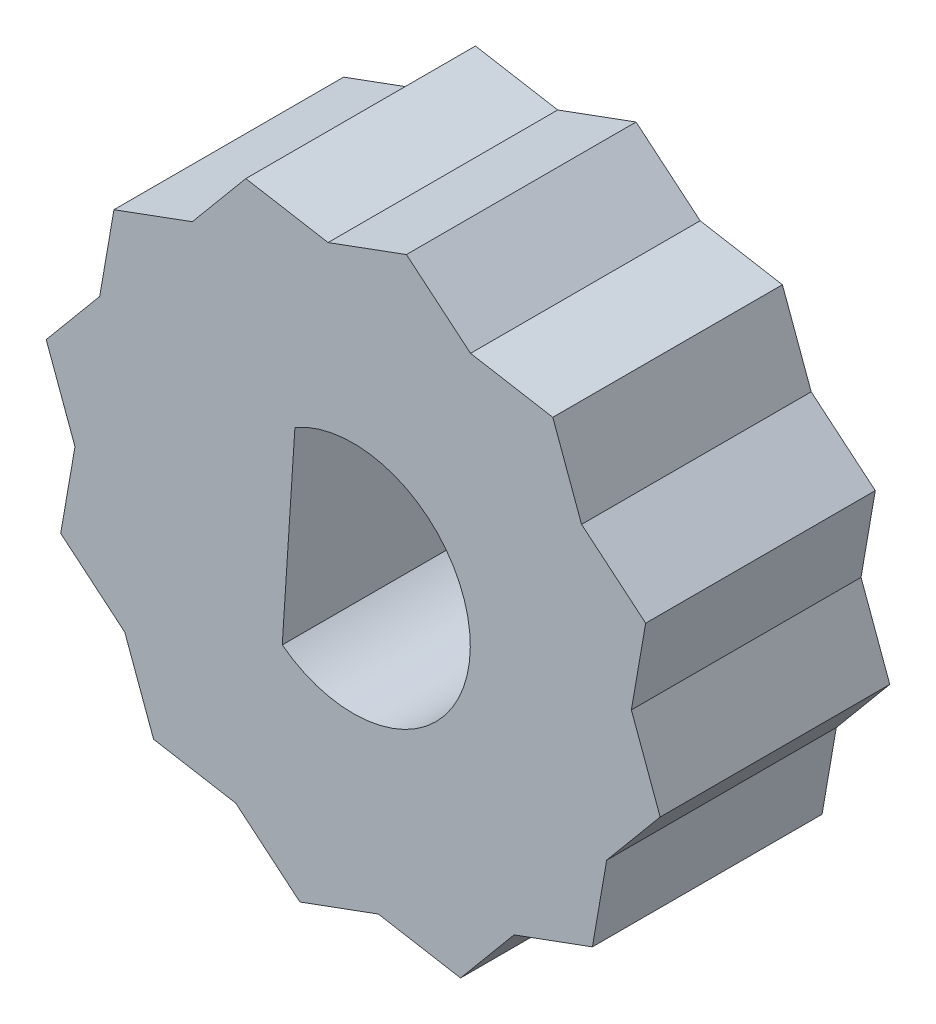
ISO-10303-21;
HEADER;
FILE_DESCRIPTION(('STEP AP214'),'2;1');
FILE_NAME('part.step','',(''),(''),'','','');
FILE_SCHEMA(('AUTOMOTIVE_DESIGN { 1 0 10303 214 1 1 1 1 }'));
ENDSEC;
DATA;
#1=APPLICATION_CONTEXT('core data for automotive mechanical design processes');
#2=APPLICATION_PROTOCOL_DEFINITION('international standard','automotive_design',2000,#1);
#3=PRODUCT_CONTEXT('',#1,'mechanical');
#4=PRODUCT('Part','Part','',(#3));
#5=PRODUCT_RELATED_PRODUCT_CATEGORY('part','',(#4));
#6=PRODUCT_DEFINITION_FORMATION('','',#4);
#7=PRODUCT_DEFINITION_CONTEXT('part definition',#1,'design');
#8=PRODUCT_DEFINITION('design','',#6,#7);
#9=PRODUCT_DEFINITION_SHAPE('','',#8);
#10=(LENGTH_UNIT() NAMED_UNIT(*) SI_UNIT(.MILLI.,.METRE.));
#11=(NAMED_UNIT(*) PLANE_ANGLE_UNIT() SI_UNIT($,.RADIAN.));
#12=(NAMED_UNIT(*) SI_UNIT($,.STERADIAN.) SOLID_ANGLE_UNIT());
#13=UNCERTAINTY_MEASURE_WITH_UNIT(LENGTH_MEASURE(1.E-05),#10,'distance_accuracy_value','');
#14=(GEOMETRIC_REPRESENTATION_CONTEXT(3) GLOBAL_UNCERTAINTY_ASSIGNED_CONTEXT((#13)) GLOBAL_UNIT_ASSIGNED_CONTEXT((#10,
#11,#12)) REPRESENTATION_CONTEXT('',''));
#15=CARTESIAN_POINT('',(0.,0.,0.));
#16=DIRECTION('',(0.,0.,1.));
#17=DIRECTION('',(1.,0.,0.));
#18=AXIS2_PLACEMENT_3D('',#15,#16,#17);
#19=CARTESIAN_POINT('',(0.,0.,10.));
#20=DIRECTION('',(0.,0.,-1.));
#21=DIRECTION('',(-1.,0.,0.));
#22=AXIS2_PLACEMENT_3D('',#19,#20,#21);
#23=CYLINDRICAL_SURFACE('',#22,5.1);
#24=CARTESIAN_POINT('',(0.,0.,0.));
#25=DIRECTION('',(0.,0.,1.));
#26=DIRECTION('',(1.,0.,0.));
#27=AXIS2_PLACEMENT_3D('',#24,#25,#26);
#28=CIRCLE('',#27,5.1);
#29=CARTESIAN_POINT('',(-3.08920951020173,-4.057928609781,0.));
#30=VERTEX_POINT('',#29);
#31=CARTESIAN_POINT('',(-2.53714814178046,4.4241246938417,0.));
#32=VERTEX_POINT('',#31);
#33=EDGE_CURVE('E243',#30,#32,#28,.T.);
#34=ORIENTED_EDGE('',*,*,#33,.F.);
#35=DIRECTION('',(0.,0.,-1.));
#36=VECTOR('',#35,1.);
#37=CARTESIAN_POINT('',(-3.08920951020173,-4.057928609781,10.));
#38=LINE('',#37,#36);
#39=CARTESIAN_POINT('',(-3.08920951020173,-4.057928609781,10.));
#40=VERTEX_POINT('',#39);
#41=EDGE_CURVE('E11',#40,#30,#38,.T.);
#42=ORIENTED_EDGE('',*,*,#41,.F.);
#43=CARTESIAN_POINT('',(0.,0.,10.));
#44=DIRECTION('',(0.,0.,1.));
#45=DIRECTION('',(1.,0.,0.));
#46=AXIS2_PLACEMENT_3D('',#43,#44,#45);
#47=CIRCLE('',#46,5.1);
#48=CARTESIAN_POINT('',(-2.53714814178046,4.4241246938417,10.));
#49=VERTEX_POINT('',#48);
#50=EDGE_CURVE('E227',#40,#49,#47,.T.);
#51=ORIENTED_EDGE('',*,*,#50,.T.);
#52=DIRECTION('',(0.,0.,-1.));
#53=VECTOR('',#52,1.);
#54=CARTESIAN_POINT('',(-2.53714814178046,4.4241246938417,10.));
#55=LINE('',#54,#53);
#56=EDGE_CURVE('E45',#49,#32,#55,.T.);
#57=ORIENTED_EDGE('',*,*,#56,.T.);
#58=EDGE_LOOP('',(#34,#42,#51,#57));
#59=FACE_BOUND('',#58,.T.);
#60=ADVANCED_FACE('F35',(#59),#23,.F.);
#61=CARTESIAN_POINT('',(-4.04929492394042,11.0302180676064,10.));
#62=DIRECTION('',(0.344620844590674,-0.938741963200544,0.));
#63=DIRECTION('',(0.938741963200544,0.344620844590674,0.));
#64=AXIS2_PLACEMENT_3D('',#61,#62,#63);
#65=PLANE('',#64);
#66=DIRECTION('',(-0.938741963200544,-0.344620844590674,0.));
#67=VECTOR('',#66,1.);
#68=CARTESIAN_POINT('',(-4.04929492394042,11.0302180676064,0.));
#69=LINE('',#68,#67);
#70=CARTESIAN_POINT('',(-7.00483294749473,9.94521276282111,0.));
#71=VERTEX_POINT('',#70);
#72=CARTESIAN_POINT('',(-10.4175942944932,8.69235655324121,0.));
#73=VERTEX_POINT('',#72);
#74=EDGE_CURVE('E288',#71,#73,#69,.T.);
#75=ORIENTED_EDGE('',*,*,#74,.T.);
#76=DIRECTION('',(0.,0.,-1.));
#77=VECTOR('',#76,1.);
#78=CARTESIAN_POINT('',(-10.4175942944932,8.69235655324121,10.));
#79=LINE('',#78,#77);
#80=CARTESIAN_POINT('',(-10.4175942944932,8.69235655324121,10.));
#81=VERTEX_POINT('',#80);
#82=EDGE_CURVE('E39',#81,#73,#79,.T.);
#83=ORIENTED_EDGE('',*,*,#82,.F.);
#84=DIRECTION('',(-0.938741963200544,-0.344620844590674,0.));
#85=VECTOR('',#84,1.);
#86=CARTESIAN_POINT('',(-4.04929492394042,11.0302180676064,10.));
#87=LINE('',#86,#85);
#88=CARTESIAN_POINT('',(-7.00483294749473,9.94521276282111,10.));
#89=VERTEX_POINT('',#88);
#90=EDGE_CURVE('E220',#89,#81,#87,.T.);
#91=ORIENTED_EDGE('',*,*,#90,.F.);
#92=DIRECTION('',(0.,0.,-1.));
#93=VECTOR('',#92,1.);
#94=CARTESIAN_POINT('',(-7.00483294749473,9.94521276282111,10.));
#95=LINE('',#94,#93);
#96=EDGE_CURVE('E230',#89,#71,#95,.T.);
#97=ORIENTED_EDGE('',*,*,#96,.T.);
#98=EDGE_LOOP('',(#75,#83,#91,#97));
#99=FACE_BOUND('',#98,.T.);
#100=ADVANCED_FACE('F37',(#99),#65,.F.);
#101=CARTESIAN_POINT('',(-11.5770965177994,2.00831676225542,10.));
#102=DIRECTION('',(0.985284810025484,-0.1709205755111,0.));
#103=DIRECTION('',(0.1709205755111,0.985284810025484,0.));
#104=AXIS2_PLACEMENT_3D('',#101,#102,#103);
#105=PLANE('',#104);
#106=DIRECTION('',(-0.1709205755111,-0.985284810025484,0.));
#107=VECTOR('',#106,1.);
#108=CARTESIAN_POINT('',(-11.5770965177994,2.00831676225542,0.));
#109=LINE('',#108,#107);
#110=CARTESIAN_POINT('',(-11.0389696632072,5.11039042489693,0.));
#111=VERTEX_POINT('',#110);
#112=EDGE_CURVE('E290',#73,#111,#109,.T.);
#113=ORIENTED_EDGE('',*,*,#112,.T.);
#114=DIRECTION('',(0.,0.,-1.));
#115=VECTOR('',#114,1.);
#116=CARTESIAN_POINT('',(-11.0389696632072,5.11039042489693,10.));
#117=LINE('',#116,#115);
#118=CARTESIAN_POINT('',(-11.0389696632072,5.11039042489693,10.));
#119=VERTEX_POINT('',#118);
#120=EDGE_CURVE('E398',#119,#111,#117,.T.);
#121=ORIENTED_EDGE('',*,*,#120,.F.);
#122=DIRECTION('',(-0.1709205755111,-0.985284810025484,0.));
#123=VECTOR('',#122,1.);
#124=CARTESIAN_POINT('',(-11.5770965177994,2.00831676225542,10.));
#125=LINE('',#124,#123);
#126=EDGE_CURVE('E147',#81,#119,#125,.T.);
#127=ORIENTED_EDGE('',*,*,#126,.F.);
#128=ORIENTED_EDGE('',*,*,#82,.T.);
#129=EDGE_LOOP('',(#113,#121,#127,#128));
#130=FACE_BOUND('',#129,.T.);
#131=ADVANCED_FACE('F403',(#130),#105,.F.);
#132=CARTESIAN_POINT('',(-9.02190130535098,7.52780159385902,10.));
#133=DIRECTION('',(0.767821387689445,-0.64066396543481,0.));
#134=DIRECTION('',(0.64066396543481,0.767821387689445,0.));
#135=AXIS2_PLACEMENT_3D('',#132,#133,#134);
#136=PLANE('',#135);
#137=DIRECTION('',(-0.64066396543481,-0.767821387689445,0.));
#138=VECTOR('',#137,1.);
#139=CARTESIAN_POINT('',(-9.02190130535098,7.52780159385902,0.));
#140=LINE('',#139,#138);
#141=CARTESIAN_POINT('',(-13.3680795819716,2.31900444661239,0.));
#142=VERTEX_POINT('',#141);
#143=EDGE_CURVE('E292',#111,#142,#140,.T.);
#144=ORIENTED_EDGE('',*,*,#143,.T.);
#145=DIRECTION('',(0.,0.,-1.));
#146=VECTOR('',#145,1.);
#147=CARTESIAN_POINT('',(-13.3680795819716,2.31900444661239,10.));
#148=LINE('',#147,#146);
#149=CARTESIAN_POINT('',(-13.3680795819716,2.31900444661239,10.));
#150=VERTEX_POINT('',#149);
#151=EDGE_CURVE('E396',#150,#142,#148,.T.);
#152=ORIENTED_EDGE('',*,*,#151,.F.);
#153=DIRECTION('',(-0.64066396543481,-0.767821387689445,0.));
#154=VECTOR('',#153,1.);
#155=CARTESIAN_POINT('',(-9.02190130535098,7.52780159385902,10.));
#156=LINE('',#155,#154);
#157=EDGE_CURVE('E241',#119,#150,#156,.T.);
#158=ORIENTED_EDGE('',*,*,#157,.F.);
#159=ORIENTED_EDGE('',*,*,#120,.T.);
#160=EDGE_LOOP('',(#144,#152,#158,#159));
#161=FACE_BOUND('',#160,.T.);
#162=ADVANCED_FACE('F411',(#161),#136,.F.);
#163=CARTESIAN_POINT('',(-11.0302180676064,-4.04929492394042,10.));
#164=DIRECTION('',(0.938741963200543,0.344620844590674,0.));
#165=DIRECTION('',(-0.344620844590674,0.938741963200543,0.));
#166=AXIS2_PLACEMENT_3D('',#163,#164,#165);
#167=PLANE('',#166);
#168=DIRECTION('',(0.344620844590674,-0.938741963200544,0.));
#169=VECTOR('',#168,1.);
#170=CARTESIAN_POINT('',(-11.0302180676064,-4.04929492394042,0.));
#171=LINE('',#170,#169);
#172=CARTESIAN_POINT('',(-12.1152233723917,-1.0937569003861,0.));
#173=VERTEX_POINT('',#172);
#174=EDGE_CURVE('E294',#142,#173,#171,.T.);
#175=ORIENTED_EDGE('',*,*,#174,.T.);
#176=DIRECTION('',(0.,0.,-1.));
#177=VECTOR('',#176,1.);
#178=CARTESIAN_POINT('',(-12.1152233723917,-1.0937569003861,10.));
#179=LINE('',#178,#177);
#180=CARTESIAN_POINT('',(-12.1152233723917,-1.0937569003861,10.));
#181=VERTEX_POINT('',#180);
#182=EDGE_CURVE('E393',#181,#173,#179,.T.);
#183=ORIENTED_EDGE('',*,*,#182,.F.);
#184=DIRECTION('',(0.344620844590674,-0.938741963200544,0.));
#185=VECTOR('',#184,1.);
#186=CARTESIAN_POINT('',(-11.0302180676064,-4.04929492394042,10.));
#187=LINE('',#186,#185);
#188=EDGE_CURVE('E247',#150,#181,#187,.T.);
#189=ORIENTED_EDGE('',*,*,#188,.F.);
#190=ORIENTED_EDGE('',*,*,#151,.T.);
#191=EDGE_LOOP('',(#175,#183,#189,#190));
#192=FACE_BOUND('',#191,.T.);
#193=ADVANCED_FACE('F414',(#192),#167,.F.);
#194=CARTESIAN_POINT('',(-11.5770965177994,2.00831676225542,10.));
#195=DIRECTION('',(0.985284810025484,-0.1709205755111,0.));
#196=DIRECTION('',(0.1709205755111,0.985284810025484,0.));
#197=AXIS2_PLACEMENT_3D('',#194,#195,#196);
#198=PLANE('',#197);
#199=DIRECTION('',(-0.1709205755111,-0.985284810025484,0.));
#200=VECTOR('',#199,1.);
#201=CARTESIAN_POINT('',(-11.5770965177994,2.00831676225542,0.));
#202=LINE('',#201,#200);
#203=CARTESIAN_POINT('',(-12.7365987411056,-4.67572302873036,0.));
#204=VERTEX_POINT('',#203);
#205=EDGE_CURVE('E296',#173,#204,#202,.T.);
#206=ORIENTED_EDGE('',*,*,#205,.T.);
#207=DIRECTION('',(0.,0.,-1.));
#208=VECTOR('',#207,1.);
#209=CARTESIAN_POINT('',(-12.7365987411056,-4.67572302873036,10.));
#210=LINE('',#209,#208);
#211=CARTESIAN_POINT('',(-12.7365987411056,-4.67572302873036,10.));
#212=VERTEX_POINT('',#211);
#213=EDGE_CURVE('E390',#212,#204,#210,.T.);
#214=ORIENTED_EDGE('',*,*,#213,.F.);
#215=DIRECTION('',(-0.1709205755111,-0.985284810025484,0.));
#216=VECTOR('',#215,1.);
#217=CARTESIAN_POINT('',(-11.5770965177994,2.00831676225542,10.));
#218=LINE('',#217,#216);
#219=EDGE_CURVE('E249',#181,#212,#218,.T.);
#220=ORIENTED_EDGE('',*,*,#219,.F.);
#221=ORIENTED_EDGE('',*,*,#182,.T.);
#222=EDGE_LOOP('',(#206,#214,#220,#221));
#223=FACE_BOUND('',#222,.T.);
#224=ADVANCED_FACE('F421',(#223),#198,.F.);
#225=CARTESIAN_POINT('',(-7.52780159385903,-9.02190130535097,10.));
#226=DIRECTION('',(0.640663965434811,0.767821387689444,0.));
#227=DIRECTION('',(-0.767821387689444,0.640663965434811,0.));
#228=AXIS2_PLACEMENT_3D('',#225,#226,#227);
#229=PLANE('',#228);
#230=DIRECTION('',(0.767821387689444,-0.640663965434811,0.));
#231=VECTOR('',#230,1.);
#232=CARTESIAN_POINT('',(-7.52780159385903,-9.02190130535097,0.));
#233=LINE('',#232,#231);
#234=CARTESIAN_POINT('',(-9.94521276282111,-7.00483294749472,0.));
#235=VERTEX_POINT('',#234);
#236=EDGE_CURVE('E298',#204,#235,#233,.T.);
#237=ORIENTED_EDGE('',*,*,#236,.T.);
#238=DIRECTION('',(0.,0.,-1.));
#239=VECTOR('',#238,1.);
#240=CARTESIAN_POINT('',(-9.94521276282111,-7.00483294749472,10.));
#241=LINE('',#240,#239);
#242=CARTESIAN_POINT('',(-9.94521276282111,-7.00483294749472,10.));
#243=VERTEX_POINT('',#242);
#244=EDGE_CURVE('E387',#243,#235,#241,.T.);
#245=ORIENTED_EDGE('',*,*,#244,.F.);
#246=DIRECTION('',(0.767821387689444,-0.640663965434811,0.));
#247=VECTOR('',#246,1.);
#248=CARTESIAN_POINT('',(-7.52780159385903,-9.02190130535097,10.));
#249=LINE('',#248,#247);
#250=EDGE_CURVE('E251',#212,#243,#249,.T.);
#251=ORIENTED_EDGE('',*,*,#250,.F.);
#252=ORIENTED_EDGE('',*,*,#213,.T.);
#253=EDGE_LOOP('',(#237,#245,#251,#252));
#254=FACE_BOUND('',#253,.T.);
#255=ADVANCED_FACE('F424',(#254),#229,.F.);
#256=CARTESIAN_POINT('',(-11.0302180676064,-4.04929492394042,10.));
#257=DIRECTION('',(0.938741963200543,0.344620844590674,0.));
#258=DIRECTION('',(-0.344620844590674,0.938741963200543,0.));
#259=AXIS2_PLACEMENT_3D('',#256,#257,#258);
#260=PLANE('',#259);
#261=DIRECTION('',(0.344620844590674,-0.938741963200544,0.));
#262=VECTOR('',#261,1.);
#263=CARTESIAN_POINT('',(-11.0302180676064,-4.04929492394042,0.));
#264=LINE('',#263,#262);
#265=CARTESIAN_POINT('',(-8.6923565532412,-10.4175942944932,0.));
#266=VERTEX_POINT('',#265);
#267=EDGE_CURVE('E300',#235,#266,#264,.T.);
#268=ORIENTED_EDGE('',*,*,#267,.T.);
#269=DIRECTION('',(0.,0.,-1.));
#270=VECTOR('',#269,1.);
#271=CARTESIAN_POINT('',(-8.6923565532412,-10.4175942944932,10.));
#272=LINE('',#271,#270);
#273=CARTESIAN_POINT('',(-8.6923565532412,-10.4175942944932,10.));
#274=VERTEX_POINT('',#273);
#275=EDGE_CURVE('E384',#274,#266,#272,.T.);
#276=ORIENTED_EDGE('',*,*,#275,.F.);
#277=DIRECTION('',(0.344620844590674,-0.938741963200544,0.));
#278=VECTOR('',#277,1.);
#279=CARTESIAN_POINT('',(-11.0302180676064,-4.04929492394042,10.));
#280=LINE('',#279,#278);
#281=EDGE_CURVE('E253',#243,#274,#280,.T.);
#282=ORIENTED_EDGE('',*,*,#281,.F.);
#283=ORIENTED_EDGE('',*,*,#244,.T.);
#284=EDGE_LOOP('',(#268,#276,#282,#283));
#285=FACE_BOUND('',#284,.T.);
#286=ADVANCED_FACE('F429',(#285),#260,.F.);
#287=CARTESIAN_POINT('',(-2.00831676225541,-11.5770965177994,10.));
#288=DIRECTION('',(0.170920575511099,0.985284810025484,0.));
#289=DIRECTION('',(-0.985284810025485,0.170920575511099,0.));
#290=AXIS2_PLACEMENT_3D('',#287,#288,#289);
#291=PLANE('',#290);
#292=DIRECTION('',(0.985284810025484,-0.170920575511099,0.));
#293=VECTOR('',#292,1.);
#294=CARTESIAN_POINT('',(-2.00831676225541,-11.5770965177994,0.));
#295=LINE('',#294,#293);
#296=CARTESIAN_POINT('',(-5.11039042489693,-11.0389696632072,0.));
#297=VERTEX_POINT('',#296);
#298=EDGE_CURVE('E302',#266,#297,#295,.T.);
#299=ORIENTED_EDGE('',*,*,#298,.T.);
#300=DIRECTION('',(0.,0.,-1.));
#301=VECTOR('',#300,1.);
#302=CARTESIAN_POINT('',(-5.11039042489693,-11.0389696632072,10.));
#303=LINE('',#302,#301);
#304=CARTESIAN_POINT('',(-5.11039042489693,-11.0389696632072,10.));
#305=VERTEX_POINT('',#304);
#306=EDGE_CURVE('E381',#305,#297,#303,.T.);
#307=ORIENTED_EDGE('',*,*,#306,.F.);
#308=DIRECTION('',(0.985284810025484,-0.170920575511099,0.));
#309=VECTOR('',#308,1.);
#310=CARTESIAN_POINT('',(-2.00831676225541,-11.5770965177994,10.));
#311=LINE('',#310,#309);
#312=EDGE_CURVE('E255',#274,#305,#311,.T.);
#313=ORIENTED_EDGE('',*,*,#312,.F.);
#314=ORIENTED_EDGE('',*,*,#275,.T.);
#315=EDGE_LOOP('',(#299,#307,#313,#314));
#316=FACE_BOUND('',#315,.T.);
#317=ADVANCED_FACE('F435',(#316),#291,.F.);
#318=CARTESIAN_POINT('',(-7.52780159385903,-9.02190130535097,10.));
#319=DIRECTION('',(0.640663965434811,0.767821387689444,0.));
#320=DIRECTION('',(-0.767821387689444,0.640663965434811,0.));
#321=AXIS2_PLACEMENT_3D('',#318,#319,#320);
#322=PLANE('',#321);
#323=DIRECTION('',(0.767821387689444,-0.640663965434811,0.));
#324=VECTOR('',#323,1.);
#325=CARTESIAN_POINT('',(-7.52780159385903,-9.02190130535097,0.));
#326=LINE('',#325,#324);
#327=CARTESIAN_POINT('',(-2.31900444661241,-13.3680795819716,0.));
#328=VERTEX_POINT('',#327);
#329=EDGE_CURVE('E304',#297,#328,#326,.T.);
#330=ORIENTED_EDGE('',*,*,#329,.T.);
#331=DIRECTION('',(0.,0.,-1.));
#332=VECTOR('',#331,1.);
#333=CARTESIAN_POINT('',(-2.31900444661241,-13.3680795819716,10.));
#334=LINE('',#333,#332);
#335=CARTESIAN_POINT('',(-2.31900444661241,-13.3680795819716,10.));
#336=VERTEX_POINT('',#335);
#337=EDGE_CURVE('E378',#336,#328,#334,.T.);
#338=ORIENTED_EDGE('',*,*,#337,.F.);
#339=DIRECTION('',(0.767821387689444,-0.640663965434811,0.));
#340=VECTOR('',#339,1.);
#341=CARTESIAN_POINT('',(-7.52780159385903,-9.02190130535097,10.));
#342=LINE('',#341,#340);
#343=EDGE_CURVE('E257',#305,#336,#342,.T.);
#344=ORIENTED_EDGE('',*,*,#343,.F.);
#345=ORIENTED_EDGE('',*,*,#306,.T.);
#346=EDGE_LOOP('',(#330,#338,#344,#345));
#347=FACE_BOUND('',#346,.T.);
#348=ADVANCED_FACE('F439',(#347),#322,.F.);
#349=CARTESIAN_POINT('',(4.04929492394041,-11.0302180676064,10.));
#350=DIRECTION('',(-0.344620844590674,0.938741963200544,0.));
#351=DIRECTION('',(-0.938741963200544,-0.344620844590674,0.));
#352=AXIS2_PLACEMENT_3D('',#349,#350,#351);
#353=PLANE('',#352);
#354=DIRECTION('',(0.938741963200544,0.344620844590674,0.));
#355=VECTOR('',#354,1.);
#356=CARTESIAN_POINT('',(4.04929492394041,-11.0302180676064,0.));
#357=LINE('',#356,#355);
#358=CARTESIAN_POINT('',(1.09375690038609,-12.1152233723917,0.));
#359=VERTEX_POINT('',#358);
#360=EDGE_CURVE('E306',#328,#359,#357,.T.);
#361=ORIENTED_EDGE('',*,*,#360,.T.);
#362=DIRECTION('',(0.,0.,-1.));
#363=VECTOR('',#362,1.);
#364=CARTESIAN_POINT('',(1.09375690038609,-12.1152233723917,10.));
#365=LINE('',#364,#363);
#366=CARTESIAN_POINT('',(1.09375690038609,-12.1152233723917,10.));
#367=VERTEX_POINT('',#366);
#368=EDGE_CURVE('E375',#367,#359,#365,.T.);
#369=ORIENTED_EDGE('',*,*,#368,.F.);
#370=DIRECTION('',(0.938741963200544,0.344620844590674,0.));
#371=VECTOR('',#370,1.);
#372=CARTESIAN_POINT('',(4.04929492394041,-11.0302180676064,10.));
#373=LINE('',#372,#371);
#374=EDGE_CURVE('E259',#336,#367,#373,.T.);
#375=ORIENTED_EDGE('',*,*,#374,.F.);
#376=ORIENTED_EDGE('',*,*,#337,.T.);
#377=EDGE_LOOP('',(#361,#369,#375,#376));
#378=FACE_BOUND('',#377,.T.);
#379=ADVANCED_FACE('F444',(#378),#353,.F.);
#380=CARTESIAN_POINT('',(-2.00831676225541,-11.5770965177994,10.));
#381=DIRECTION('',(0.170920575511099,0.985284810025484,0.));
#382=DIRECTION('',(-0.985284810025485,0.170920575511099,0.));
#383=AXIS2_PLACEMENT_3D('',#380,#381,#382);
#384=PLANE('',#383);
#385=DIRECTION('',(0.985284810025484,-0.170920575511099,0.));
#386=VECTOR('',#385,1.);
#387=CARTESIAN_POINT('',(-2.00831676225541,-11.5770965177994,0.));
#388=LINE('',#387,#386);
#389=CARTESIAN_POINT('',(4.67572302873038,-12.7365987411056,0.));
#390=VERTEX_POINT('',#389);
#391=EDGE_CURVE('E308',#359,#390,#388,.T.);
#392=ORIENTED_EDGE('',*,*,#391,.T.);
#393=DIRECTION('',(0.,0.,-1.));
#394=VECTOR('',#393,1.);
#395=CARTESIAN_POINT('',(4.67572302873038,-12.7365987411056,10.));
#396=LINE('',#395,#394);
#397=CARTESIAN_POINT('',(4.67572302873038,-12.7365987411056,10.));
#398=VERTEX_POINT('',#397);
#399=EDGE_CURVE('E372',#398,#390,#396,.T.);
#400=ORIENTED_EDGE('',*,*,#399,.F.);
#401=DIRECTION('',(0.985284810025484,-0.170920575511099,0.));
#402=VECTOR('',#401,1.);
#403=CARTESIAN_POINT('',(-2.00831676225541,-11.5770965177994,10.));
#404=LINE('',#403,#402);
#405=EDGE_CURVE('E261',#367,#398,#404,.T.);
#406=ORIENTED_EDGE('',*,*,#405,.F.);
#407=ORIENTED_EDGE('',*,*,#368,.T.);
#408=EDGE_LOOP('',(#392,#400,#406,#407));
#409=FACE_BOUND('',#408,.T.);
#410=ADVANCED_FACE('F450',(#409),#384,.F.);
#411=CARTESIAN_POINT('',(9.02190130535098,-7.52780159385902,10.));
#412=DIRECTION('',(-0.767821387689445,0.64066396543481,0.));
#413=DIRECTION('',(-0.64066396543481,-0.767821387689445,0.));
#414=AXIS2_PLACEMENT_3D('',#411,#412,#413);
#415=PLANE('',#414);
#416=DIRECTION('',(0.64066396543481,0.767821387689445,0.));
#417=VECTOR('',#416,1.);
#418=CARTESIAN_POINT('',(9.02190130535098,-7.52780159385902,0.));
#419=LINE('',#418,#417);
#420=CARTESIAN_POINT('',(7.00483294749474,-9.9452127628211,0.));
#421=VERTEX_POINT('',#420);
#422=EDGE_CURVE('E310',#390,#421,#419,.T.);
#423=ORIENTED_EDGE('',*,*,#422,.T.);
#424=DIRECTION('',(0.,0.,-1.));
#425=VECTOR('',#424,1.);
#426=CARTESIAN_POINT('',(7.00483294749474,-9.9452127628211,10.));
#427=LINE('',#426,#425);
#428=CARTESIAN_POINT('',(7.00483294749474,-9.9452127628211,10.));
#429=VERTEX_POINT('',#428);
#430=EDGE_CURVE('E369',#429,#421,#427,.T.);
#431=ORIENTED_EDGE('',*,*,#430,.F.);
#432=DIRECTION('',(0.64066396543481,0.767821387689445,0.));
#433=VECTOR('',#432,1.);
#434=CARTESIAN_POINT('',(9.02190130535098,-7.52780159385902,10.));
#435=LINE('',#434,#433);
#436=EDGE_CURVE('E263',#398,#429,#435,.T.);
#437=ORIENTED_EDGE('',*,*,#436,.F.);
#438=ORIENTED_EDGE('',*,*,#399,.T.);
#439=EDGE_LOOP('',(#423,#431,#437,#438));
#440=FACE_BOUND('',#439,.T.);
#441=ADVANCED_FACE('F454',(#440),#415,.F.);
#442=CARTESIAN_POINT('',(4.04929492394041,-11.0302180676064,10.));
#443=DIRECTION('',(-0.344620844590674,0.938741963200544,0.));
#444=DIRECTION('',(-0.938741963200544,-0.344620844590674,0.));
#445=AXIS2_PLACEMENT_3D('',#442,#443,#444);
#446=PLANE('',#445);
#447=DIRECTION('',(0.938741963200544,0.344620844590674,0.));
#448=VECTOR('',#447,1.);
#449=CARTESIAN_POINT('',(4.04929492394041,-11.0302180676064,0.));
#450=LINE('',#449,#448);
#451=CARTESIAN_POINT('',(10.4175942944932,-8.6923565532412,0.));
#452=VERTEX_POINT('',#451);
#453=EDGE_CURVE('E312',#421,#452,#450,.T.);
#454=ORIENTED_EDGE('',*,*,#453,.T.);
#455=DIRECTION('',(0.,0.,-1.));
#456=VECTOR('',#455,1.);
#457=CARTESIAN_POINT('',(10.4175942944932,-8.6923565532412,10.));
#458=LINE('',#457,#456);
#459=CARTESIAN_POINT('',(10.4175942944932,-8.6923565532412,10.));
#460=VERTEX_POINT('',#459);
#461=EDGE_CURVE('E366',#460,#452,#458,.T.);
#462=ORIENTED_EDGE('',*,*,#461,.F.);
#463=DIRECTION('',(0.938741963200544,0.344620844590674,0.));
#464=VECTOR('',#463,1.);
#465=CARTESIAN_POINT('',(4.04929492394041,-11.0302180676064,10.));
#466=LINE('',#465,#464);
#467=EDGE_CURVE('E265',#429,#460,#466,.T.);
#468=ORIENTED_EDGE('',*,*,#467,.F.);
#469=ORIENTED_EDGE('',*,*,#430,.T.);
#470=EDGE_LOOP('',(#454,#462,#468,#469));
#471=FACE_BOUND('',#470,.T.);
#472=ADVANCED_FACE('F459',(#471),#446,.F.);
#473=CARTESIAN_POINT('',(11.5770965177994,-2.00831676225542,10.));
#474=DIRECTION('',(-0.985284810025484,0.1709205755111,0.));
#475=DIRECTION('',(-0.1709205755111,-0.985284810025484,0.));
#476=AXIS2_PLACEMENT_3D('',#473,#474,#475);
#477=PLANE('',#476);
#478=DIRECTION('',(0.1709205755111,0.985284810025484,0.));
#479=VECTOR('',#478,1.);
#480=CARTESIAN_POINT('',(11.5770965177994,-2.00831676225542,0.));
#481=LINE('',#480,#479);
#482=CARTESIAN_POINT('',(11.0389696632072,-5.11039042489694,0.));
#483=VERTEX_POINT('',#482);
#484=EDGE_CURVE('E314',#452,#483,#481,.T.);
#485=ORIENTED_EDGE('',*,*,#484,.T.);
#486=DIRECTION('',(0.,0.,-1.));
#487=VECTOR('',#486,1.);
#488=CARTESIAN_POINT('',(11.0389696632072,-5.11039042489694,10.));
#489=LINE('',#488,#487);
#490=CARTESIAN_POINT('',(11.0389696632072,-5.11039042489694,10.));
#491=VERTEX_POINT('',#490);
#492=EDGE_CURVE('E363',#491,#483,#489,.T.);
#493=ORIENTED_EDGE('',*,*,#492,.F.);
#494=DIRECTION('',(0.1709205755111,0.985284810025484,0.));
#495=VECTOR('',#494,1.);
#496=CARTESIAN_POINT('',(11.5770965177994,-2.00831676225542,10.));
#497=LINE('',#496,#495);
#498=EDGE_CURVE('E267',#460,#491,#497,.T.);
#499=ORIENTED_EDGE('',*,*,#498,.F.);
#500=ORIENTED_EDGE('',*,*,#461,.T.);
#501=EDGE_LOOP('',(#485,#493,#499,#500));
#502=FACE_BOUND('',#501,.T.);
#503=ADVANCED_FACE('F465',(#502),#477,.F.);
#504=CARTESIAN_POINT('',(9.02190130535098,-7.52780159385902,10.));
#505=DIRECTION('',(-0.767821387689445,0.64066396543481,0.));
#506=DIRECTION('',(-0.64066396543481,-0.767821387689445,0.));
#507=AXIS2_PLACEMENT_3D('',#504,#505,#506);
#508=PLANE('',#507);
#509=DIRECTION('',(0.64066396543481,0.767821387689445,0.));
#510=VECTOR('',#509,1.);
#511=CARTESIAN_POINT('',(9.02190130535098,-7.52780159385902,0.));
#512=LINE('',#511,#510);
#513=CARTESIAN_POINT('',(13.3680795819716,-2.3190044466124,0.));
#514=VERTEX_POINT('',#513);
#515=EDGE_CURVE('E316',#483,#514,#512,.T.);
#516=ORIENTED_EDGE('',*,*,#515,.T.);
#517=DIRECTION('',(0.,0.,-1.));
#518=VECTOR('',#517,1.);
#519=CARTESIAN_POINT('',(13.3680795819716,-2.3190044466124,10.));
#520=LINE('',#519,#518);
#521=CARTESIAN_POINT('',(13.3680795819716,-2.3190044466124,10.));
#522=VERTEX_POINT('',#521);
#523=EDGE_CURVE('E360',#522,#514,#520,.T.);
#524=ORIENTED_EDGE('',*,*,#523,.F.);
#525=DIRECTION('',(0.64066396543481,0.767821387689445,0.));
#526=VECTOR('',#525,1.);
#527=CARTESIAN_POINT('',(9.02190130535098,-7.52780159385902,10.));
#528=LINE('',#527,#526);
#529=EDGE_CURVE('E269',#491,#522,#528,.T.);
#530=ORIENTED_EDGE('',*,*,#529,.F.);
#531=ORIENTED_EDGE('',*,*,#492,.T.);
#532=EDGE_LOOP('',(#516,#524,#530,#531));
#533=FACE_BOUND('',#532,.T.);
#534=ADVANCED_FACE('F469',(#533),#508,.F.);
#535=CARTESIAN_POINT('',(11.0302180676064,4.04929492394042,10.));
#536=DIRECTION('',(-0.938741963200543,-0.344620844590674,0.));
#537=DIRECTION('',(0.344620844590674,-0.938741963200543,0.));
#538=AXIS2_PLACEMENT_3D('',#535,#536,#537);
#539=PLANE('',#538);
#540=DIRECTION('',(-0.344620844590674,0.938741963200544,0.));
#541=VECTOR('',#540,1.);
#542=CARTESIAN_POINT('',(11.0302180676064,4.04929492394042,0.));
#543=LINE('',#542,#541);
#544=CARTESIAN_POINT('',(12.1152233723917,1.0937569003861,0.));
#545=VERTEX_POINT('',#544);
#546=EDGE_CURVE('E318',#514,#545,#543,.T.);
#547=ORIENTED_EDGE('',*,*,#546,.T.);
#548=DIRECTION('',(0.,0.,-1.));
#549=VECTOR('',#548,1.);
#550=CARTESIAN_POINT('',(12.1152233723917,1.0937569003861,10.));
#551=LINE('',#550,#549);
#552=CARTESIAN_POINT('',(12.1152233723917,1.0937569003861,10.));
#553=VERTEX_POINT('',#552);
#554=EDGE_CURVE('E357',#553,#545,#551,.T.);
#555=ORIENTED_EDGE('',*,*,#554,.F.);
#556=DIRECTION('',(-0.344620844590674,0.938741963200544,0.));
#557=VECTOR('',#556,1.);
#558=CARTESIAN_POINT('',(11.0302180676064,4.04929492394042,10.));
#559=LINE('',#558,#557);
#560=EDGE_CURVE('E271',#522,#553,#559,.T.);
#561=ORIENTED_EDGE('',*,*,#560,.F.);
#562=ORIENTED_EDGE('',*,*,#523,.T.);
#563=EDGE_LOOP('',(#547,#555,#561,#562));
#564=FACE_BOUND('',#563,.T.);
#565=ADVANCED_FACE('F474',(#564),#539,.F.);
#566=CARTESIAN_POINT('',(11.5770965177994,-2.00831676225542,10.));
#567=DIRECTION('',(-0.985284810025484,0.1709205755111,0.));
#568=DIRECTION('',(-0.1709205755111,-0.985284810025484,0.));
#569=AXIS2_PLACEMENT_3D('',#566,#567,#568);
#570=PLANE('',#569);
#571=DIRECTION('',(0.1709205755111,0.985284810025484,0.));
#572=VECTOR('',#571,1.);
#573=CARTESIAN_POINT('',(11.5770965177994,-2.00831676225542,0.));
#574=LINE('',#573,#572);
#575=CARTESIAN_POINT('',(12.7365987411056,4.67572302873037,0.));
#576=VERTEX_POINT('',#575);
#577=EDGE_CURVE('E320',#545,#576,#574,.T.);
#578=ORIENTED_EDGE('',*,*,#577,.T.);
#579=DIRECTION('',(0.,0.,-1.));
#580=VECTOR('',#579,1.);
#581=CARTESIAN_POINT('',(12.7365987411056,4.67572302873037,10.));
#582=LINE('',#581,#580);
#583=CARTESIAN_POINT('',(12.7365987411056,4.67572302873037,10.));
#584=VERTEX_POINT('',#583);
#585=EDGE_CURVE('E354',#584,#576,#582,.T.);
#586=ORIENTED_EDGE('',*,*,#585,.F.);
#587=DIRECTION('',(0.1709205755111,0.985284810025484,0.));
#588=VECTOR('',#587,1.);
#589=CARTESIAN_POINT('',(11.5770965177994,-2.00831676225542,10.));
#590=LINE('',#589,#588);
#591=EDGE_CURVE('E273',#553,#584,#590,.T.);
#592=ORIENTED_EDGE('',*,*,#591,.F.);
#593=ORIENTED_EDGE('',*,*,#554,.T.);
#594=EDGE_LOOP('',(#578,#586,#592,#593));
#595=FACE_BOUND('',#594,.T.);
#596=ADVANCED_FACE('F480',(#595),#570,.F.);
#597=CARTESIAN_POINT('',(7.52780159385903,9.02190130535097,10.));
#598=DIRECTION('',(-0.640663965434811,-0.767821387689444,0.));
#599=DIRECTION('',(0.767821387689444,-0.640663965434811,0.));
#600=AXIS2_PLACEMENT_3D('',#597,#598,#599);
#601=PLANE('',#600);
#602=DIRECTION('',(-0.767821387689444,0.640663965434811,0.));
#603=VECTOR('',#602,1.);
#604=CARTESIAN_POINT('',(7.52780159385903,9.02190130535097,0.));
#605=LINE('',#604,#603);
#606=CARTESIAN_POINT('',(9.94521276282111,7.00483294749473,0.));
#607=VERTEX_POINT('',#606);
#608=EDGE_CURVE('E322',#576,#607,#605,.T.);
#609=ORIENTED_EDGE('',*,*,#608,.T.);
#610=DIRECTION('',(0.,0.,-1.));
#611=VECTOR('',#610,1.);
#612=CARTESIAN_POINT('',(9.94521276282111,7.00483294749473,10.));
#613=LINE('',#612,#611);
#614=CARTESIAN_POINT('',(9.94521276282111,7.00483294749473,10.));
#615=VERTEX_POINT('',#614);
#616=EDGE_CURVE('E351',#615,#607,#613,.T.);
#617=ORIENTED_EDGE('',*,*,#616,.F.);
#618=DIRECTION('',(-0.767821387689444,0.640663965434811,0.));
#619=VECTOR('',#618,1.);
#620=CARTESIAN_POINT('',(7.52780159385903,9.02190130535097,10.));
#621=LINE('',#620,#619);
#622=EDGE_CURVE('E275',#584,#615,#621,.T.);
#623=ORIENTED_EDGE('',*,*,#622,.F.);
#624=ORIENTED_EDGE('',*,*,#585,.T.);
#625=EDGE_LOOP('',(#609,#617,#623,#624));
#626=FACE_BOUND('',#625,.T.);
#627=ADVANCED_FACE('F484',(#626),#601,.F.);
#628=CARTESIAN_POINT('',(11.0302180676064,4.04929492394042,10.));
#629=DIRECTION('',(-0.938741963200543,-0.344620844590674,0.));
#630=DIRECTION('',(0.344620844590674,-0.938741963200543,0.));
#631=AXIS2_PLACEMENT_3D('',#628,#629,#630);
#632=PLANE('',#631);
#633=DIRECTION('',(-0.344620844590674,0.938741963200544,0.));
#634=VECTOR('',#633,1.);
#635=CARTESIAN_POINT('',(11.0302180676064,4.04929492394042,0.));
#636=LINE('',#635,#634);
#637=CARTESIAN_POINT('',(8.6923565532412,10.4175942944932,0.));
#638=VERTEX_POINT('',#637);
#639=EDGE_CURVE('E324',#607,#638,#636,.T.);
#640=ORIENTED_EDGE('',*,*,#639,.T.);
#641=DIRECTION('',(0.,0.,-1.));
#642=VECTOR('',#641,1.);
#643=CARTESIAN_POINT('',(8.6923565532412,10.4175942944932,10.));
#644=LINE('',#643,#642);
#645=CARTESIAN_POINT('',(8.6923565532412,10.4175942944932,10.));
#646=VERTEX_POINT('',#645);
#647=EDGE_CURVE('E348',#646,#638,#644,.T.);
#648=ORIENTED_EDGE('',*,*,#647,.F.);
#649=DIRECTION('',(-0.344620844590674,0.938741963200544,0.));
#650=VECTOR('',#649,1.);
#651=CARTESIAN_POINT('',(11.0302180676064,4.04929492394042,10.));
#652=LINE('',#651,#650);
#653=EDGE_CURVE('E277',#615,#646,#652,.T.);
#654=ORIENTED_EDGE('',*,*,#653,.F.);
#655=ORIENTED_EDGE('',*,*,#616,.T.);
#656=EDGE_LOOP('',(#640,#648,#654,#655));
#657=FACE_BOUND('',#656,.T.);
#658=ADVANCED_FACE('F489',(#657),#632,.F.);
#659=CARTESIAN_POINT('',(2.00831676225541,11.5770965177994,10.));
#660=DIRECTION('',(-0.170920575511099,-0.985284810025484,0.));
#661=DIRECTION('',(0.985284810025484,-0.170920575511099,0.));
#662=AXIS2_PLACEMENT_3D('',#659,#660,#661);
#663=PLANE('',#662);
#664=DIRECTION('',(-0.985284810025484,0.170920575511099,0.));
#665=VECTOR('',#664,1.);
#666=CARTESIAN_POINT('',(2.00831676225541,11.5770965177994,0.));
#667=LINE('',#666,#665);
#668=CARTESIAN_POINT('',(5.11039042489694,11.0389696632072,0.));
#669=VERTEX_POINT('',#668);
#670=EDGE_CURVE('E326',#638,#669,#667,.T.);
#671=ORIENTED_EDGE('',*,*,#670,.T.);
#672=DIRECTION('',(0.,0.,-1.));
#673=VECTOR('',#672,1.);
#674=CARTESIAN_POINT('',(5.11039042489694,11.0389696632072,10.));
#675=LINE('',#674,#673);
#676=CARTESIAN_POINT('',(5.11039042489694,11.0389696632072,10.));
#677=VERTEX_POINT('',#676);
#678=EDGE_CURVE('E345',#677,#669,#675,.T.);
#679=ORIENTED_EDGE('',*,*,#678,.F.);
#680=DIRECTION('',(-0.985284810025484,0.170920575511099,0.));
#681=VECTOR('',#680,1.);
#682=CARTESIAN_POINT('',(2.00831676225541,11.5770965177994,10.));
#683=LINE('',#682,#681);
#684=EDGE_CURVE('E279',#646,#677,#683,.T.);
#685=ORIENTED_EDGE('',*,*,#684,.F.);
#686=ORIENTED_EDGE('',*,*,#647,.T.);
#687=EDGE_LOOP('',(#671,#679,#685,#686));
#688=FACE_BOUND('',#687,.T.);
#689=ADVANCED_FACE('F495',(#688),#663,.F.);
#690=CARTESIAN_POINT('',(7.52780159385903,9.02190130535097,10.));
#691=DIRECTION('',(-0.640663965434811,-0.767821387689444,0.));
#692=DIRECTION('',(0.767821387689444,-0.640663965434811,0.));
#693=AXIS2_PLACEMENT_3D('',#690,#691,#692);
#694=PLANE('',#693);
#695=DIRECTION('',(-0.767821387689444,0.640663965434811,0.));
#696=VECTOR('',#695,1.);
#697=CARTESIAN_POINT('',(7.52780159385903,9.02190130535097,0.));
#698=LINE('',#697,#696);
#699=CARTESIAN_POINT('',(2.31900444661241,13.3680795819716,0.));
#700=VERTEX_POINT('',#699);
#701=EDGE_CURVE('E328',#669,#700,#698,.T.);
#702=ORIENTED_EDGE('',*,*,#701,.T.);
#703=DIRECTION('',(0.,0.,-1.));
#704=VECTOR('',#703,1.);
#705=CARTESIAN_POINT('',(2.31900444661241,13.3680795819716,10.));
#706=LINE('',#705,#704);
#707=CARTESIAN_POINT('',(2.31900444661241,13.3680795819716,10.));
#708=VERTEX_POINT('',#707);
#709=EDGE_CURVE('E342',#708,#700,#706,.T.);
#710=ORIENTED_EDGE('',*,*,#709,.F.);
#711=DIRECTION('',(-0.767821387689444,0.640663965434811,0.));
#712=VECTOR('',#711,1.);
#713=CARTESIAN_POINT('',(7.52780159385903,9.02190130535097,10.));
#714=LINE('',#713,#712);
#715=EDGE_CURVE('E281',#677,#708,#714,.T.);
#716=ORIENTED_EDGE('',*,*,#715,.F.);
#717=ORIENTED_EDGE('',*,*,#678,.T.);
#718=EDGE_LOOP('',(#702,#710,#716,#717));
#719=FACE_BOUND('',#718,.T.);
#720=ADVANCED_FACE('F499',(#719),#694,.F.);
#721=CARTESIAN_POINT('',(-4.04929492394042,11.0302180676064,10.));
#722=DIRECTION('',(0.344620844590674,-0.938741963200544,0.));
#723=DIRECTION('',(0.938741963200544,0.344620844590674,0.));
#724=AXIS2_PLACEMENT_3D('',#721,#722,#723);
#725=PLANE('',#724);
#726=DIRECTION('',(-0.938741963200544,-0.344620844590674,0.));
#727=VECTOR('',#726,1.);
#728=CARTESIAN_POINT('',(-4.04929492394042,11.0302180676064,0.));
#729=LINE('',#728,#727);
#730=CARTESIAN_POINT('',(-1.0937569003861,12.1152233723917,0.));
#731=VERTEX_POINT('',#730);
#732=EDGE_CURVE('E330',#700,#731,#729,.T.);
#733=ORIENTED_EDGE('',*,*,#732,.T.);
#734=DIRECTION('',(0.,0.,-1.));
#735=VECTOR('',#734,1.);
#736=CARTESIAN_POINT('',(-1.0937569003861,12.1152233723917,10.));
#737=LINE('',#736,#735);
#738=CARTESIAN_POINT('',(-1.0937569003861,12.1152233723917,10.));
#739=VERTEX_POINT('',#738);
#740=EDGE_CURVE('E339',#739,#731,#737,.T.);
#741=ORIENTED_EDGE('',*,*,#740,.F.);
#742=DIRECTION('',(-0.938741963200544,-0.344620844590674,0.));
#743=VECTOR('',#742,1.);
#744=CARTESIAN_POINT('',(-4.04929492394042,11.0302180676064,10.));
#745=LINE('',#744,#743);
#746=EDGE_CURVE('E283',#708,#739,#745,.T.);
#747=ORIENTED_EDGE('',*,*,#746,.F.);
#748=ORIENTED_EDGE('',*,*,#709,.T.);
#749=EDGE_LOOP('',(#733,#741,#747,#748));
#750=FACE_BOUND('',#749,.T.);
#751=ADVANCED_FACE('F504',(#750),#725,.F.);
#752=CARTESIAN_POINT('',(2.00831676225541,11.5770965177994,10.));
#753=DIRECTION('',(-0.170920575511099,-0.985284810025484,0.));
#754=DIRECTION('',(0.985284810025484,-0.170920575511099,0.));
#755=AXIS2_PLACEMENT_3D('',#752,#753,#754);
#756=PLANE('',#755);
#757=DIRECTION('',(-0.985284810025484,0.170920575511099,0.));
#758=VECTOR('',#757,1.);
#759=CARTESIAN_POINT('',(2.00831676225541,11.5770965177994,0.));
#760=LINE('',#759,#758);
#761=CARTESIAN_POINT('',(-4.67572302873037,12.7365987411056,0.));
#762=VERTEX_POINT('',#761);
#763=EDGE_CURVE('E332',#731,#762,#760,.T.);
#764=ORIENTED_EDGE('',*,*,#763,.T.);
#765=DIRECTION('',(0.,0.,-1.));
#766=VECTOR('',#765,1.);
#767=CARTESIAN_POINT('',(-4.67572302873037,12.7365987411056,10.));
#768=LINE('',#767,#766);
#769=CARTESIAN_POINT('',(-4.67572302873037,12.7365987411056,10.));
#770=VERTEX_POINT('',#769);
#771=EDGE_CURVE('E237',#770,#762,#768,.T.);
#772=ORIENTED_EDGE('',*,*,#771,.F.);
#773=DIRECTION('',(-0.985284810025484,0.170920575511099,0.));
#774=VECTOR('',#773,1.);
#775=CARTESIAN_POINT('',(2.00831676225541,11.5770965177994,10.));
#776=LINE('',#775,#774);
#777=EDGE_CURVE('E223',#739,#770,#776,.T.);
#778=ORIENTED_EDGE('',*,*,#777,.F.);
#779=ORIENTED_EDGE('',*,*,#740,.T.);
#780=EDGE_LOOP('',(#764,#772,#778,#779));
#781=FACE_BOUND('',#780,.T.);
#782=ADVANCED_FACE('F506',(#781),#756,.F.);
#783=CARTESIAN_POINT('',(-9.02190130535098,7.52780159385902,10.));
#784=DIRECTION('',(0.767821387689445,-0.64066396543481,0.));
#785=DIRECTION('',(0.64066396543481,0.767821387689445,0.));
#786=AXIS2_PLACEMENT_3D('',#783,#784,#785);
#787=PLANE('',#786);
#788=DIRECTION('',(-0.64066396543481,-0.767821387689445,0.));
#789=VECTOR('',#788,1.);
#790=CARTESIAN_POINT('',(-9.02190130535098,7.52780159385902,0.));
#791=LINE('',#790,#789);
#792=EDGE_CURVE('E233',#762,#71,#791,.T.);
#793=ORIENTED_EDGE('',*,*,#792,.T.);
#794=ORIENTED_EDGE('',*,*,#96,.F.);
#795=DIRECTION('',(-0.64066396543481,-0.767821387689445,0.));
#796=VECTOR('',#795,1.);
#797=CARTESIAN_POINT('',(-9.02190130535098,7.52780159385902,10.));
#798=LINE('',#797,#796);
#799=EDGE_CURVE('E216',#770,#89,#798,.T.);
#800=ORIENTED_EDGE('',*,*,#799,.F.);
#801=ORIENTED_EDGE('',*,*,#771,.T.);
#802=EDGE_LOOP('',(#793,#794,#800,#801));
#803=FACE_BOUND('',#802,.T.);
#804=ADVANCED_FACE('F231',(#803),#787,.F.);
#805=CARTESIAN_POINT('',(-2.8131788259911,0.183098042030351,10.));
#806=DIRECTION('',(-0.997888623955612,0.0649483962848553,0.));
#807=DIRECTION('',(-0.0649483962848553,-0.997888623955612,0.));
#808=AXIS2_PLACEMENT_3D('',#805,#806,#807);
#809=PLANE('',#808);
#810=DIRECTION('',(0.0649483962848553,0.997888623955612,0.));
#811=VECTOR('',#810,1.);
#812=CARTESIAN_POINT('',(-2.8131788259911,0.183098042030351,0.));
#813=LINE('',#812,#811);
#814=EDGE_CURVE('E239',#30,#32,#813,.T.);
#815=ORIENTED_EDGE('',*,*,#814,.T.);
#816=ORIENTED_EDGE('',*,*,#56,.F.);
#817=DIRECTION('',(0.0649483962848553,0.997888623955612,0.));
#818=VECTOR('',#817,1.);
#819=CARTESIAN_POINT('',(-2.8131788259911,0.183098042030351,10.));
#820=LINE('',#819,#818);
#821=EDGE_CURVE('E53',#40,#49,#820,.T.);
#822=ORIENTED_EDGE('',*,*,#821,.F.);
#823=ORIENTED_EDGE('',*,*,#41,.T.);
#824=EDGE_LOOP('',(#815,#816,#822,#823));
#825=FACE_BOUND('',#824,.T.);
#826=ADVANCED_FACE('F513',(#825),#809,.F.);
#827=CARTESIAN_POINT('',(0.,0.,10.));
#828=DIRECTION('',(0.,0.,1.));
#829=DIRECTION('',(1.,0.,0.));
#830=AXIS2_PLACEMENT_3D('',#827,#828,#829);
#831=PLANE('',#830);
#832=ORIENTED_EDGE('',*,*,#90,.T.);
#833=ORIENTED_EDGE('',*,*,#126,.T.);
#834=ORIENTED_EDGE('',*,*,#157,.T.);
#835=ORIENTED_EDGE('',*,*,#188,.T.);
#836=ORIENTED_EDGE('',*,*,#219,.T.);
#837=ORIENTED_EDGE('',*,*,#250,.T.);
#838=ORIENTED_EDGE('',*,*,#281,.T.);
#839=ORIENTED_EDGE('',*,*,#312,.T.);
#840=ORIENTED_EDGE('',*,*,#343,.T.);
#841=ORIENTED_EDGE('',*,*,#374,.T.);
#842=ORIENTED_EDGE('',*,*,#405,.T.);
#843=ORIENTED_EDGE('',*,*,#436,.T.);
#844=ORIENTED_EDGE('',*,*,#467,.T.);
#845=ORIENTED_EDGE('',*,*,#498,.T.);
#846=ORIENTED_EDGE('',*,*,#529,.T.);
#847=ORIENTED_EDGE('',*,*,#560,.T.);
#848=ORIENTED_EDGE('',*,*,#591,.T.);
#849=ORIENTED_EDGE('',*,*,#622,.T.);
#850=ORIENTED_EDGE('',*,*,#653,.T.);
#851=ORIENTED_EDGE('',*,*,#684,.T.);
#852=ORIENTED_EDGE('',*,*,#715,.T.);
#853=ORIENTED_EDGE('',*,*,#746,.T.);
#854=ORIENTED_EDGE('',*,*,#777,.T.);
#855=ORIENTED_EDGE('',*,*,#799,.T.);
#856=EDGE_LOOP('',(#832,#833,#834,#835,#836,#837,#838,#839,#840,#841,#842,#843,#844,#845,#846,
#847,#848,#849,#850,#851,#852,#853,#854,#855));
#857=FACE_BOUND('',#856,.T.);
#858=ORIENTED_EDGE('',*,*,#50,.F.);
#859=ORIENTED_EDGE('',*,*,#821,.T.);
#860=EDGE_LOOP('',(#858,#859));
#861=FACE_BOUND('',#860,.T.);
#862=ADVANCED_FACE('F218',(#857,#861),#831,.T.);
#863=CARTESIAN_POINT('',(0.,0.,0.));
#864=DIRECTION('',(0.,0.,1.));
#865=DIRECTION('',(1.,0.,0.));
#866=AXIS2_PLACEMENT_3D('',#863,#864,#865);
#867=PLANE('',#866);
#868=ORIENTED_EDGE('',*,*,#74,.F.);
#869=ORIENTED_EDGE('',*,*,#792,.F.);
#870=ORIENTED_EDGE('',*,*,#763,.F.);
#871=ORIENTED_EDGE('',*,*,#732,.F.);
#872=ORIENTED_EDGE('',*,*,#701,.F.);
#873=ORIENTED_EDGE('',*,*,#670,.F.);
#874=ORIENTED_EDGE('',*,*,#639,.F.);
#875=ORIENTED_EDGE('',*,*,#608,.F.);
#876=ORIENTED_EDGE('',*,*,#577,.F.);
#877=ORIENTED_EDGE('',*,*,#546,.F.);
#878=ORIENTED_EDGE('',*,*,#515,.F.);
#879=ORIENTED_EDGE('',*,*,#484,.F.);
#880=ORIENTED_EDGE('',*,*,#453,.F.);
#881=ORIENTED_EDGE('',*,*,#422,.F.);
#882=ORIENTED_EDGE('',*,*,#391,.F.);
#883=ORIENTED_EDGE('',*,*,#360,.F.);
#884=ORIENTED_EDGE('',*,*,#329,.F.);
#885=ORIENTED_EDGE('',*,*,#298,.F.);
#886=ORIENTED_EDGE('',*,*,#267,.F.);
#887=ORIENTED_EDGE('',*,*,#236,.F.);
#888=ORIENTED_EDGE('',*,*,#205,.F.);
#889=ORIENTED_EDGE('',*,*,#174,.F.);
#890=ORIENTED_EDGE('',*,*,#143,.F.);
#891=ORIENTED_EDGE('',*,*,#112,.F.);
#892=EDGE_LOOP('',(#868,#869,#870,#871,#872,#873,#874,#875,#876,#877,#878,#879,#880,#881,#882,
#883,#884,#885,#886,#887,#888,#889,#890,#891));
#893=FACE_BOUND('',#892,.T.);
#894=ORIENTED_EDGE('',*,*,#33,.T.);
#895=ORIENTED_EDGE('',*,*,#814,.F.);
#896=EDGE_LOOP('',(#894,#895));
#897=FACE_BOUND('',#896,.T.);
#898=ADVANCED_FACE('F405',(#893,#897),#867,.F.);
#899=CLOSED_SHELL('',(#60,#100,#131,#162,#193,#224,#255,#286,#317,#348,#379,#410,#441,#472,#503,
#534,#565,#596,#627,#658,#689,#720,#751,#782,#804,#826,#862,#898));
#900=MANIFOLD_SOLID_BREP('B2',#899);
#901=ADVANCED_BREP_SHAPE_REPRESENTATION('',(#18,#900),#14);
#902=SHAPE_DEFINITION_REPRESENTATION(#9,#901);
ENDSEC;
END-ISO-10303-21;
